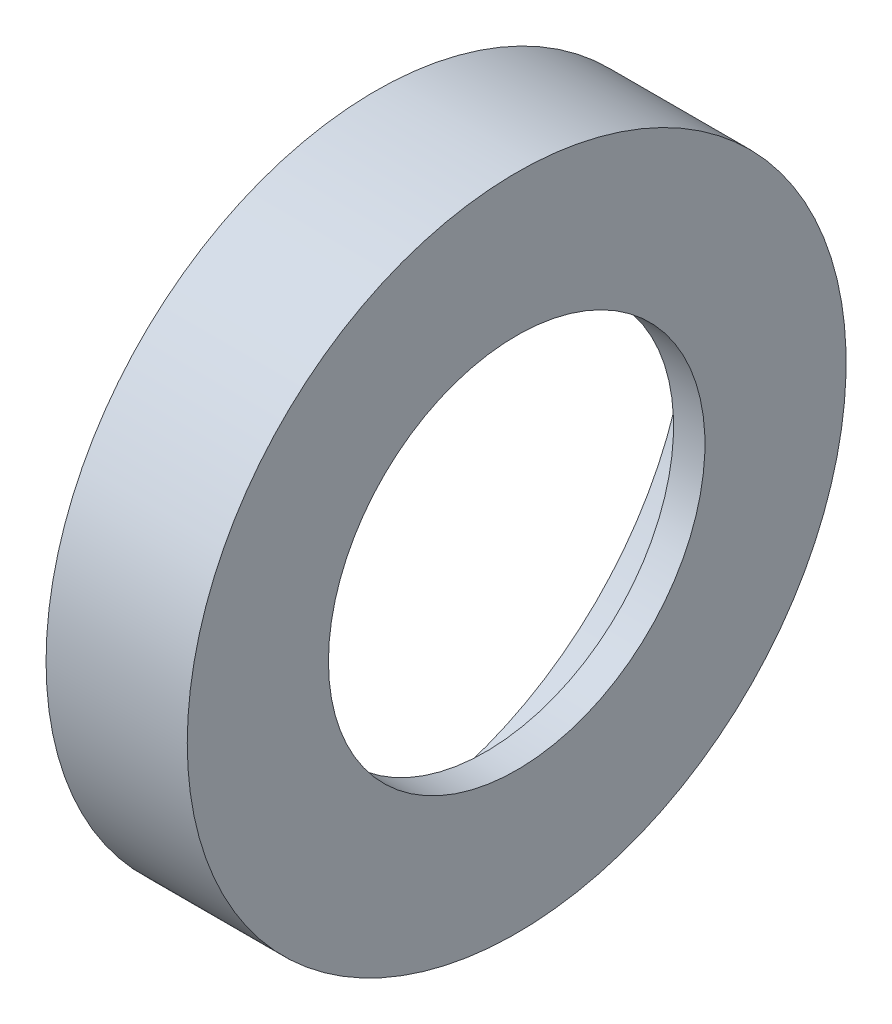
ISO-10303-21;
HEADER;
FILE_DESCRIPTION(('STEP AP214'),'2;1');
FILE_NAME('part.step','',(''),(''),'','','');
FILE_SCHEMA(('AUTOMOTIVE_DESIGN { 1 0 10303 214 1 1 1 1 }'));
ENDSEC;
DATA;
#1=APPLICATION_CONTEXT('core data for automotive mechanical design processes');
#2=APPLICATION_PROTOCOL_DEFINITION('international standard','automotive_design',2000,#1);
#3=PRODUCT_CONTEXT('',#1,'mechanical');
#4=PRODUCT('Part','Part','',(#3));
#5=PRODUCT_RELATED_PRODUCT_CATEGORY('part','',(#4));
#6=PRODUCT_DEFINITION_FORMATION('','',#4);
#7=PRODUCT_DEFINITION_CONTEXT('part definition',#1,'design');
#8=PRODUCT_DEFINITION('design','',#6,#7);
#9=PRODUCT_DEFINITION_SHAPE('','',#8);
#10=(LENGTH_UNIT() NAMED_UNIT(*) SI_UNIT(.MILLI.,.METRE.));
#11=(NAMED_UNIT(*) PLANE_ANGLE_UNIT() SI_UNIT($,.RADIAN.));
#12=(NAMED_UNIT(*) SI_UNIT($,.STERADIAN.) SOLID_ANGLE_UNIT());
#13=UNCERTAINTY_MEASURE_WITH_UNIT(LENGTH_MEASURE(1.E-05),#10,'distance_accuracy_value','');
#14=(GEOMETRIC_REPRESENTATION_CONTEXT(3) GLOBAL_UNCERTAINTY_ASSIGNED_CONTEXT((#13)) GLOBAL_UNIT_ASSIGNED_CONTEXT((#10,
#11,#12)) REPRESENTATION_CONTEXT('',''));
#15=CARTESIAN_POINT('',(0.,0.,0.));
#16=DIRECTION('',(0.,0.,1.));
#17=DIRECTION('',(1.,0.,0.));
#18=AXIS2_PLACEMENT_3D('',#15,#16,#17);
#19=CARTESIAN_POINT('',(-18.,42.,0.));
#20=DIRECTION('',(1.,0.,0.));
#21=DIRECTION('',(0.,0.,-1.));
#22=AXIS2_PLACEMENT_3D('',#19,#20,#21);
#23=PLANE('',#22);
#24=CARTESIAN_POINT('',(-18.,0.,0.));
#25=DIRECTION('',(-1.,0.,0.));
#26=DIRECTION('',(0.,0.,1.));
#27=AXIS2_PLACEMENT_3D('',#24,#25,#26);
#28=CIRCLE('',#27,40.);
#29=CARTESIAN_POINT('',(-18.,0.,40.));
#30=VERTEX_POINT('',#29);
#31=EDGE_CURVE('E10',#30,#30,#28,.T.);
#32=ORIENTED_EDGE('',*,*,#31,.F.);
#33=EDGE_LOOP('',(#32));
#34=FACE_BOUND('',#33,.T.);
#35=CARTESIAN_POINT('',(-18.,0.,0.));
#36=DIRECTION('',(-1.,0.,0.));
#37=DIRECTION('',(0.,0.,1.));
#38=AXIS2_PLACEMENT_3D('',#35,#36,#37);
#39=CIRCLE('',#38,42.);
#40=CARTESIAN_POINT('',(-18.,0.,42.));
#41=VERTEX_POINT('',#40);
#42=EDGE_CURVE('E59',#41,#41,#39,.T.);
#43=ORIENTED_EDGE('',*,*,#42,.T.);
#44=EDGE_LOOP('',(#43));
#45=FACE_BOUND('',#44,.T.);
#46=ADVANCED_FACE('F31',(#34,#45),#23,.F.);
#47=CARTESIAN_POINT('',(-32.8527957024392,0.,0.));
#48=DIRECTION('',(-1.,0.,0.));
#49=DIRECTION('',(0.,0.,1.));
#50=AXIS2_PLACEMENT_3D('',#47,#48,#49);
#51=CYLINDRICAL_SURFACE('',#50,40.);
#52=CARTESIAN_POINT('',(-8.,0.,0.));
#53=DIRECTION('',(-1.,0.,0.));
#54=DIRECTION('',(0.,0.,1.));
#55=AXIS2_PLACEMENT_3D('',#52,#53,#54);
#56=CIRCLE('',#55,40.);
#57=CARTESIAN_POINT('',(-8.,0.,40.));
#58=VERTEX_POINT('',#57);
#59=EDGE_CURVE('E37',#58,#58,#56,.T.);
#60=ORIENTED_EDGE('',*,*,#59,.F.);
#61=EDGE_LOOP('',(#60));
#62=FACE_BOUND('',#61,.T.);
#63=ORIENTED_EDGE('',*,*,#31,.T.);
#64=EDGE_LOOP('',(#63));
#65=FACE_BOUND('',#64,.T.);
#66=ADVANCED_FACE('F96',(#62,#65),#51,.F.);
#67=CARTESIAN_POINT('',(-8.,40.,0.));
#68=DIRECTION('',(1.,0.,0.));
#69=DIRECTION('',(0.,0.,-1.));
#70=AXIS2_PLACEMENT_3D('',#67,#68,#69);
#71=PLANE('',#70);
#72=CARTESIAN_POINT('',(-8.,0.,0.));
#73=DIRECTION('',(-1.,0.,0.));
#74=DIRECTION('',(0.,0.,1.));
#75=AXIS2_PLACEMENT_3D('',#72,#73,#74);
#76=CIRCLE('',#75,37.65);
#77=CARTESIAN_POINT('',(-8.,0.,37.65));
#78=VERTEX_POINT('',#77);
#79=EDGE_CURVE('E41',#78,#78,#76,.T.);
#80=ORIENTED_EDGE('',*,*,#79,.F.);
#81=EDGE_LOOP('',(#80));
#82=FACE_BOUND('',#81,.T.);
#83=ORIENTED_EDGE('',*,*,#59,.T.);
#84=EDGE_LOOP('',(#83));
#85=FACE_BOUND('',#84,.T.);
#86=ADVANCED_FACE('F91',(#82,#85),#71,.F.);
#87=CARTESIAN_POINT('',(-32.8527957024392,0.,0.));
#88=DIRECTION('',(-1.,0.,0.));
#89=DIRECTION('',(0.,0.,1.));
#90=AXIS2_PLACEMENT_3D('',#87,#88,#89);
#91=CYLINDRICAL_SURFACE('',#90,37.65);
#92=CARTESIAN_POINT('',(-4.,0.,0.));
#93=DIRECTION('',(-1.,0.,0.));
#94=DIRECTION('',(0.,0.,1.));
#95=AXIS2_PLACEMENT_3D('',#92,#93,#94);
#96=CIRCLE('',#95,37.65);
#97=CARTESIAN_POINT('',(-4.,0.,37.65));
#98=VERTEX_POINT('',#97);
#99=EDGE_CURVE('E45',#98,#98,#96,.T.);
#100=ORIENTED_EDGE('',*,*,#99,.F.);
#101=EDGE_LOOP('',(#100));
#102=FACE_BOUND('',#101,.T.);
#103=ORIENTED_EDGE('',*,*,#79,.T.);
#104=EDGE_LOOP('',(#103));
#105=FACE_BOUND('',#104,.T.);
#106=ADVANCED_FACE('F85',(#102,#105),#91,.F.);
#107=CARTESIAN_POINT('',(-4.,37.65,0.));
#108=DIRECTION('',(1.,0.,0.));
#109=DIRECTION('',(0.,0.,-1.));
#110=AXIS2_PLACEMENT_3D('',#107,#108,#109);
#111=PLANE('',#110);
#112=CARTESIAN_POINT('',(-4.,0.,0.));
#113=DIRECTION('',(-1.,0.,0.));
#114=DIRECTION('',(0.,0.,1.));
#115=AXIS2_PLACEMENT_3D('',#112,#113,#114);
#116=CIRCLE('',#115,24.);
#117=CARTESIAN_POINT('',(-4.,0.,24.));
#118=VERTEX_POINT('',#117);
#119=EDGE_CURVE('E50',#118,#118,#116,.T.);
#120=ORIENTED_EDGE('',*,*,#119,.F.);
#121=EDGE_LOOP('',(#120));
#122=FACE_BOUND('',#121,.T.);
#123=ORIENTED_EDGE('',*,*,#99,.T.);
#124=EDGE_LOOP('',(#123));
#125=FACE_BOUND('',#124,.T.);
#126=ADVANCED_FACE('F79',(#122,#125),#111,.F.);
#127=CARTESIAN_POINT('',(-32.8527957024392,0.,0.));
#128=DIRECTION('',(-1.,0.,0.));
#129=DIRECTION('',(0.,0.,1.));
#130=AXIS2_PLACEMENT_3D('',#127,#128,#129);
#131=CYLINDRICAL_SURFACE('',#130,24.);
#132=CARTESIAN_POINT('',(0.,0.,0.));
#133=DIRECTION('',(-1.,0.,0.));
#134=DIRECTION('',(0.,0.,1.));
#135=AXIS2_PLACEMENT_3D('',#132,#133,#134);
#136=CIRCLE('',#135,24.);
#137=CARTESIAN_POINT('',(0.,0.,24.));
#138=VERTEX_POINT('',#137);
#139=EDGE_CURVE('E53',#138,#138,#136,.T.);
#140=ORIENTED_EDGE('',*,*,#139,.F.);
#141=EDGE_LOOP('',(#140));
#142=FACE_BOUND('',#141,.T.);
#143=ORIENTED_EDGE('',*,*,#119,.T.);
#144=EDGE_LOOP('',(#143));
#145=FACE_BOUND('',#144,.T.);
#146=ADVANCED_FACE('F73',(#142,#145),#131,.F.);
#147=CARTESIAN_POINT('',(0.,24.,0.));
#148=DIRECTION('',(-1.,0.,0.));
#149=DIRECTION('',(0.,0.,1.));
#150=AXIS2_PLACEMENT_3D('',#147,#148,#149);
#151=PLANE('',#150);
#152=CARTESIAN_POINT('',(0.,0.,0.));
#153=DIRECTION('',(-1.,0.,0.));
#154=DIRECTION('',(0.,0.,1.));
#155=AXIS2_PLACEMENT_3D('',#152,#153,#154);
#156=CIRCLE('',#155,42.);
#157=CARTESIAN_POINT('',(0.,0.,42.));
#158=VERTEX_POINT('',#157);
#159=EDGE_CURVE('E56',#158,#158,#156,.T.);
#160=ORIENTED_EDGE('',*,*,#159,.F.);
#161=EDGE_LOOP('',(#160));
#162=FACE_BOUND('',#161,.T.);
#163=ORIENTED_EDGE('',*,*,#139,.T.);
#164=EDGE_LOOP('',(#163));
#165=FACE_BOUND('',#164,.T.);
#166=ADVANCED_FACE('F67',(#162,#165),#151,.F.);
#167=CARTESIAN_POINT('',(-32.8527957024392,0.,0.));
#168=DIRECTION('',(-1.,0.,0.));
#169=DIRECTION('',(0.,0.,1.));
#170=AXIS2_PLACEMENT_3D('',#167,#168,#169);
#171=CYLINDRICAL_SURFACE('',#170,42.);
#172=ORIENTED_EDGE('',*,*,#42,.F.);
#173=EDGE_LOOP('',(#172));
#174=FACE_BOUND('',#173,.T.);
#175=ORIENTED_EDGE('',*,*,#159,.T.);
#176=EDGE_LOOP('',(#175));
#177=FACE_BOUND('',#176,.T.);
#178=ADVANCED_FACE('F64',(#174,#177),#171,.T.);
#179=CLOSED_SHELL('',(#46,#66,#86,#106,#126,#146,#166,#178));
#180=MANIFOLD_SOLID_BREP('B2',#179);
#181=ADVANCED_BREP_SHAPE_REPRESENTATION('',(#18,#180),#14);
#182=SHAPE_DEFINITION_REPRESENTATION(#9,#181);
ENDSEC;
END-ISO-10303-21;
